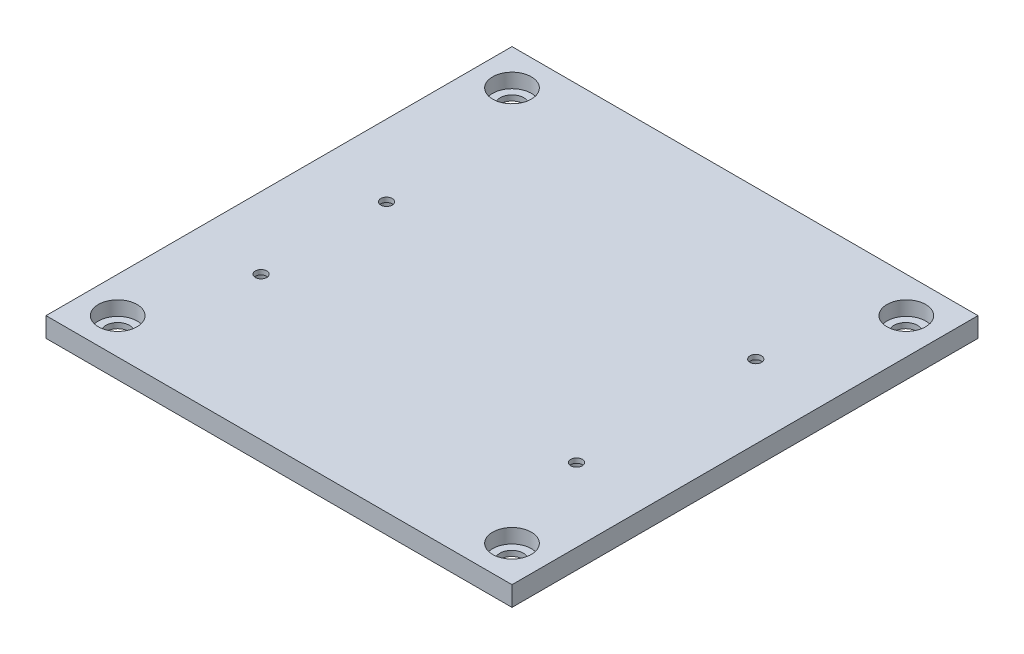
ISO-10303-21;
HEADER;
FILE_DESCRIPTION(('STEP AP214'),'2;1');
FILE_NAME('part.step','',(''),(''),'','','');
FILE_SCHEMA(('AUTOMOTIVE_DESIGN { 1 0 10303 214 1 1 1 1 }'));
ENDSEC;
DATA;
#1=APPLICATION_CONTEXT('core data for automotive mechanical design processes');
#2=APPLICATION_PROTOCOL_DEFINITION('international standard','automotive_design',2000,#1);
#3=PRODUCT_CONTEXT('',#1,'mechanical');
#4=PRODUCT('Part','Part','',(#3));
#5=PRODUCT_RELATED_PRODUCT_CATEGORY('part','',(#4));
#6=PRODUCT_DEFINITION_FORMATION('','',#4);
#7=PRODUCT_DEFINITION_CONTEXT('part definition',#1,'design');
#8=PRODUCT_DEFINITION('design','',#6,#7);
#9=PRODUCT_DEFINITION_SHAPE('','',#8);
#10=(LENGTH_UNIT() NAMED_UNIT(*) SI_UNIT(.MILLI.,.METRE.));
#11=(NAMED_UNIT(*) PLANE_ANGLE_UNIT() SI_UNIT($,.RADIAN.));
#12=(NAMED_UNIT(*) SI_UNIT($,.STERADIAN.) SOLID_ANGLE_UNIT());
#13=UNCERTAINTY_MEASURE_WITH_UNIT(LENGTH_MEASURE(1.E-05),#10,'distance_accuracy_value','');
#14=(GEOMETRIC_REPRESENTATION_CONTEXT(3) GLOBAL_UNCERTAINTY_ASSIGNED_CONTEXT((#13)) GLOBAL_UNIT_ASSIGNED_CONTEXT((#10,
#11,#12)) REPRESENTATION_CONTEXT('',''));
#15=CARTESIAN_POINT('',(0.,0.,0.));
#16=DIRECTION('',(0.,0.,1.));
#17=DIRECTION('',(1.,0.,0.));
#18=AXIS2_PLACEMENT_3D('',#15,#16,#17);
#19=CARTESIAN_POINT('',(0.,5.5,0.));
#20=DIRECTION('',(1.,0.,0.));
#21=DIRECTION('',(0.,0.,-1.));
#22=AXIS2_PLACEMENT_3D('',#19,#20,#21);
#23=PLANE('',#22);
#24=DIRECTION('',(0.,0.,1.));
#25=VECTOR('',#24,1.);
#26=CARTESIAN_POINT('',(0.,0.,0.));
#27=LINE('',#26,#25);
#28=CARTESIAN_POINT('',(0.,0.,-130.));
#29=VERTEX_POINT('',#28);
#30=CARTESIAN_POINT('',(0.,0.,0.));
#31=VERTEX_POINT('',#30);
#32=EDGE_CURVE('E109',#29,#31,#27,.T.);
#33=ORIENTED_EDGE('',*,*,#32,.T.);
#34=DIRECTION('',(0.,-1.,0.));
#35=VECTOR('',#34,1.);
#36=CARTESIAN_POINT('',(0.,5.5,0.));
#37=LINE('',#36,#35);
#38=CARTESIAN_POINT('',(0.,5.5,0.));
#39=VERTEX_POINT('',#38);
#40=EDGE_CURVE('E11',#39,#31,#37,.T.);
#41=ORIENTED_EDGE('',*,*,#40,.F.);
#42=DIRECTION('',(0.,0.,1.));
#43=VECTOR('',#42,1.);
#44=CARTESIAN_POINT('',(0.,5.5,0.));
#45=LINE('',#44,#43);
#46=CARTESIAN_POINT('',(0.,5.5,-130.));
#47=VERTEX_POINT('',#46);
#48=EDGE_CURVE('E93',#47,#39,#45,.T.);
#49=ORIENTED_EDGE('',*,*,#48,.F.);
#50=DIRECTION('',(0.,-1.,0.));
#51=VECTOR('',#50,1.);
#52=CARTESIAN_POINT('',(0.,5.5,-130.));
#53=LINE('',#52,#51);
#54=EDGE_CURVE('E105',#47,#29,#53,.T.);
#55=ORIENTED_EDGE('',*,*,#54,.T.);
#56=EDGE_LOOP('',(#33,#41,#49,#55));
#57=FACE_BOUND('',#56,.T.);
#58=ADVANCED_FACE('F41',(#57),#23,.F.);
#59=CARTESIAN_POINT('',(0.,5.5,0.));
#60=DIRECTION('',(0.,0.,-1.));
#61=DIRECTION('',(-1.,0.,0.));
#62=AXIS2_PLACEMENT_3D('',#59,#60,#61);
#63=PLANE('',#62);
#64=DIRECTION('',(1.,0.,0.));
#65=VECTOR('',#64,1.);
#66=CARTESIAN_POINT('',(0.,0.,0.));
#67=LINE('',#66,#65);
#68=CARTESIAN_POINT('',(130.,0.,0.));
#69=VERTEX_POINT('',#68);
#70=EDGE_CURVE('E98',#31,#69,#67,.T.);
#71=ORIENTED_EDGE('',*,*,#70,.T.);
#72=DIRECTION('',(0.,-1.,0.));
#73=VECTOR('',#72,1.);
#74=CARTESIAN_POINT('',(130.,5.5,0.));
#75=LINE('',#74,#73);
#76=CARTESIAN_POINT('',(130.,5.5,0.));
#77=VERTEX_POINT('',#76);
#78=EDGE_CURVE('E50',#77,#69,#75,.T.);
#79=ORIENTED_EDGE('',*,*,#78,.F.);
#80=DIRECTION('',(1.,0.,0.));
#81=VECTOR('',#80,1.);
#82=CARTESIAN_POINT('',(0.,5.5,0.));
#83=LINE('',#82,#81);
#84=EDGE_CURVE('E88',#39,#77,#83,.T.);
#85=ORIENTED_EDGE('',*,*,#84,.F.);
#86=ORIENTED_EDGE('',*,*,#40,.T.);
#87=EDGE_LOOP('',(#71,#79,#85,#86));
#88=FACE_BOUND('',#87,.T.);
#89=ADVANCED_FACE('F97',(#88),#63,.F.);
#90=CARTESIAN_POINT('',(130.,5.5,0.));
#91=DIRECTION('',(-1.,0.,0.));
#92=DIRECTION('',(0.,0.,1.));
#93=AXIS2_PLACEMENT_3D('',#90,#91,#92);
#94=PLANE('',#93);
#95=DIRECTION('',(0.,0.,-1.));
#96=VECTOR('',#95,1.);
#97=CARTESIAN_POINT('',(130.,0.,0.));
#98=LINE('',#97,#96);
#99=CARTESIAN_POINT('',(130.,0.,-130.));
#100=VERTEX_POINT('',#99);
#101=EDGE_CURVE('E75',#69,#100,#98,.T.);
#102=ORIENTED_EDGE('',*,*,#101,.T.);
#103=DIRECTION('',(0.,-1.,0.));
#104=VECTOR('',#103,1.);
#105=CARTESIAN_POINT('',(130.,5.5,-130.));
#106=LINE('',#105,#104);
#107=CARTESIAN_POINT('',(130.,5.5,-130.));
#108=VERTEX_POINT('',#107);
#109=EDGE_CURVE('E100',#108,#100,#106,.T.);
#110=ORIENTED_EDGE('',*,*,#109,.F.);
#111=DIRECTION('',(0.,0.,-1.));
#112=VECTOR('',#111,1.);
#113=CARTESIAN_POINT('',(130.,5.5,0.));
#114=LINE('',#113,#112);
#115=EDGE_CURVE('E91',#77,#108,#114,.T.);
#116=ORIENTED_EDGE('',*,*,#115,.F.);
#117=ORIENTED_EDGE('',*,*,#78,.T.);
#118=EDGE_LOOP('',(#102,#110,#116,#117));
#119=FACE_BOUND('',#118,.T.);
#120=ADVANCED_FACE('F101',(#119),#94,.F.);
#121=CARTESIAN_POINT('',(0.,5.5,-130.));
#122=DIRECTION('',(0.,0.,1.));
#123=DIRECTION('',(1.,0.,0.));
#124=AXIS2_PLACEMENT_3D('',#121,#122,#123);
#125=PLANE('',#124);
#126=DIRECTION('',(-1.,0.,0.));
#127=VECTOR('',#126,1.);
#128=CARTESIAN_POINT('',(0.,0.,-130.));
#129=LINE('',#128,#127);
#130=EDGE_CURVE('E81',#100,#29,#129,.T.);
#131=ORIENTED_EDGE('',*,*,#130,.T.);
#132=ORIENTED_EDGE('',*,*,#54,.F.);
#133=DIRECTION('',(-1.,0.,0.));
#134=VECTOR('',#133,1.);
#135=CARTESIAN_POINT('',(0.,5.5,-130.));
#136=LINE('',#135,#134);
#137=EDGE_CURVE('E58',#108,#47,#136,.T.);
#138=ORIENTED_EDGE('',*,*,#137,.F.);
#139=ORIENTED_EDGE('',*,*,#109,.T.);
#140=EDGE_LOOP('',(#131,#132,#138,#139));
#141=FACE_BOUND('',#140,.T.);
#142=ADVANCED_FACE('F123',(#141),#125,.F.);
#143=CARTESIAN_POINT('',(0.,5.5,0.));
#144=DIRECTION('',(0.,-1.,0.));
#145=DIRECTION('',(0.,0.,-1.));
#146=AXIS2_PLACEMENT_3D('',#143,#144,#145);
#147=PLANE('',#146);
#148=CARTESIAN_POINT('',(109.5,5.5,-88.5));
#149=DIRECTION('',(0.,-1.,0.));
#150=DIRECTION('',(0.,0.,-1.));
#151=AXIS2_PLACEMENT_3D('',#148,#149,#150);
#152=CIRCLE('',#151,1.60000000000001);
#153=CARTESIAN_POINT('',(109.5,5.5,-90.1));
#154=VERTEX_POINT('',#153);
#155=EDGE_CURVE('E238',#154,#154,#152,.T.);
#156=ORIENTED_EDGE('',*,*,#155,.T.);
#157=EDGE_LOOP('',(#156));
#158=FACE_BOUND('',#157,.T.);
#159=CARTESIAN_POINT('',(109.5,5.5,-38.5));
#160=DIRECTION('',(0.,-1.,0.));
#161=DIRECTION('',(0.,0.,-1.));
#162=AXIS2_PLACEMENT_3D('',#159,#160,#161);
#163=CIRCLE('',#162,1.60000000000001);
#164=CARTESIAN_POINT('',(109.5,5.5,-40.1));
#165=VERTEX_POINT('',#164);
#166=EDGE_CURVE('E246',#165,#165,#163,.T.);
#167=ORIENTED_EDGE('',*,*,#166,.T.);
#168=EDGE_LOOP('',(#167));
#169=FACE_BOUND('',#168,.T.);
#170=CARTESIAN_POINT('',(20.,5.5,-75.));
#171=DIRECTION('',(0.,-1.,0.));
#172=DIRECTION('',(0.,0.,-1.));
#173=AXIS2_PLACEMENT_3D('',#170,#171,#172);
#174=CIRCLE('',#173,1.6);
#175=CARTESIAN_POINT('',(20.,5.5,-76.6));
#176=VERTEX_POINT('',#175);
#177=EDGE_CURVE('E230',#176,#176,#174,.T.);
#178=ORIENTED_EDGE('',*,*,#177,.T.);
#179=EDGE_LOOP('',(#178));
#180=FACE_BOUND('',#179,.T.);
#181=CARTESIAN_POINT('',(20.,5.5,-40.));
#182=DIRECTION('',(0.,-1.,0.));
#183=DIRECTION('',(0.,0.,-1.));
#184=AXIS2_PLACEMENT_3D('',#181,#182,#183);
#185=CIRCLE('',#184,1.6);
#186=CARTESIAN_POINT('',(20.,5.5,-41.6));
#187=VERTEX_POINT('',#186);
#188=EDGE_CURVE('E207',#187,#187,#185,.T.);
#189=ORIENTED_EDGE('',*,*,#188,.T.);
#190=EDGE_LOOP('',(#189));
#191=FACE_BOUND('',#190,.T.);
#192=CARTESIAN_POINT('',(10.,5.5,-120.));
#193=DIRECTION('',(0.,1.,0.));
#194=DIRECTION('',(0.,0.,1.));
#195=AXIS2_PLACEMENT_3D('',#192,#193,#194);
#196=CIRCLE('',#195,5.4);
#197=CARTESIAN_POINT('',(10.,5.5,-114.6));
#198=VERTEX_POINT('',#197);
#199=EDGE_CURVE('E142',#198,#198,#196,.T.);
#200=ORIENTED_EDGE('',*,*,#199,.F.);
#201=EDGE_LOOP('',(#200));
#202=FACE_BOUND('',#201,.T.);
#203=CARTESIAN_POINT('',(120.,5.5,-120.));
#204=DIRECTION('',(0.,1.,0.));
#205=DIRECTION('',(0.,0.,1.));
#206=AXIS2_PLACEMENT_3D('',#203,#204,#205);
#207=CIRCLE('',#206,5.4);
#208=CARTESIAN_POINT('',(120.,5.5,-114.6));
#209=VERTEX_POINT('',#208);
#210=EDGE_CURVE('E151',#209,#209,#207,.T.);
#211=ORIENTED_EDGE('',*,*,#210,.F.);
#212=EDGE_LOOP('',(#211));
#213=FACE_BOUND('',#212,.T.);
#214=CARTESIAN_POINT('',(120.,5.5,-10.));
#215=DIRECTION('',(0.,1.,0.));
#216=DIRECTION('',(0.,0.,1.));
#217=AXIS2_PLACEMENT_3D('',#214,#215,#216);
#218=CIRCLE('',#217,5.39999999999999);
#219=CARTESIAN_POINT('',(120.,5.5,-4.60000000000001));
#220=VERTEX_POINT('',#219);
#221=EDGE_CURVE('E134',#220,#220,#218,.T.);
#222=ORIENTED_EDGE('',*,*,#221,.F.);
#223=EDGE_LOOP('',(#222));
#224=FACE_BOUND('',#223,.T.);
#225=CARTESIAN_POINT('',(10.,5.5,-10.));
#226=DIRECTION('',(0.,1.,0.));
#227=DIRECTION('',(0.,0.,1.));
#228=AXIS2_PLACEMENT_3D('',#225,#226,#227);
#229=CIRCLE('',#228,5.4);
#230=CARTESIAN_POINT('',(10.,5.5,-4.6));
#231=VERTEX_POINT('',#230);
#232=EDGE_CURVE('E130',#231,#231,#229,.T.);
#233=ORIENTED_EDGE('',*,*,#232,.F.);
#234=EDGE_LOOP('',(#233));
#235=FACE_BOUND('',#234,.T.);
#236=ORIENTED_EDGE('',*,*,#48,.T.);
#237=ORIENTED_EDGE('',*,*,#84,.T.);
#238=ORIENTED_EDGE('',*,*,#115,.T.);
#239=ORIENTED_EDGE('',*,*,#137,.T.);
#240=EDGE_LOOP('',(#236,#237,#238,#239));
#241=FACE_BOUND('',#240,.T.);
#242=ADVANCED_FACE('F89',(#158,#169,#180,#191,#202,#213,#224,#235,#241),#147,.F.);
#243=CARTESIAN_POINT('',(0.,0.,0.));
#244=DIRECTION('',(0.,-1.,0.));
#245=DIRECTION('',(0.,0.,-1.));
#246=AXIS2_PLACEMENT_3D('',#243,#244,#245);
#247=PLANE('',#246);
#248=CARTESIAN_POINT('',(109.5,0.,-88.5));
#249=DIRECTION('',(0.,-1.,0.));
#250=DIRECTION('',(0.,0.,-1.));
#251=AXIS2_PLACEMENT_3D('',#248,#249,#250);
#252=CIRCLE('',#251,3.1);
#253=CARTESIAN_POINT('',(109.5,0.,-91.6));
#254=VERTEX_POINT('',#253);
#255=EDGE_CURVE('E202',#254,#254,#252,.T.);
#256=ORIENTED_EDGE('',*,*,#255,.F.);
#257=EDGE_LOOP('',(#256));
#258=FACE_BOUND('',#257,.T.);
#259=CARTESIAN_POINT('',(109.5,0.,-38.5));
#260=DIRECTION('',(0.,-1.,0.));
#261=DIRECTION('',(0.,0.,-1.));
#262=AXIS2_PLACEMENT_3D('',#259,#260,#261);
#263=CIRCLE('',#262,3.1);
#264=CARTESIAN_POINT('',(109.5,0.,-41.6));
#265=VERTEX_POINT('',#264);
#266=EDGE_CURVE('E211',#265,#265,#263,.T.);
#267=ORIENTED_EDGE('',*,*,#266,.F.);
#268=EDGE_LOOP('',(#267));
#269=FACE_BOUND('',#268,.T.);
#270=CARTESIAN_POINT('',(20.,0.,-75.));
#271=DIRECTION('',(0.,-1.,0.));
#272=DIRECTION('',(0.,0.,-1.));
#273=AXIS2_PLACEMENT_3D('',#270,#271,#272);
#274=CIRCLE('',#273,3.1);
#275=CARTESIAN_POINT('',(20.,0.,-78.1));
#276=VERTEX_POINT('',#275);
#277=EDGE_CURVE('E219',#276,#276,#274,.T.);
#278=ORIENTED_EDGE('',*,*,#277,.F.);
#279=EDGE_LOOP('',(#278));
#280=FACE_BOUND('',#279,.T.);
#281=CARTESIAN_POINT('',(20.,0.,-40.));
#282=DIRECTION('',(0.,-1.,0.));
#283=DIRECTION('',(0.,0.,-1.));
#284=AXIS2_PLACEMENT_3D('',#281,#282,#283);
#285=CIRCLE('',#284,3.1);
#286=CARTESIAN_POINT('',(20.,0.,-43.1));
#287=VERTEX_POINT('',#286);
#288=EDGE_CURVE('E194',#287,#287,#285,.T.);
#289=ORIENTED_EDGE('',*,*,#288,.F.);
#290=EDGE_LOOP('',(#289));
#291=FACE_BOUND('',#290,.T.);
#292=CARTESIAN_POINT('',(119.916006428739,0.,-119.916006428739));
#293=DIRECTION('',(0.,1.,0.));
#294=DIRECTION('',(0.,0.,1.));
#295=AXIS2_PLACEMENT_3D('',#292,#293,#294);
#296=CIRCLE('',#295,3.3);
#297=CARTESIAN_POINT('',(119.916006428739,0.,-116.616006428739));
#298=VERTEX_POINT('',#297);
#299=EDGE_CURVE('E166',#298,#298,#296,.T.);
#300=ORIENTED_EDGE('',*,*,#299,.T.);
#301=EDGE_LOOP('',(#300));
#302=FACE_BOUND('',#301,.T.);
#303=CARTESIAN_POINT('',(10.,0.,-10.));
#304=DIRECTION('',(0.,1.,0.));
#305=DIRECTION('',(0.,0.,1.));
#306=AXIS2_PLACEMENT_3D('',#303,#304,#305);
#307=CIRCLE('',#306,3.3);
#308=CARTESIAN_POINT('',(10.,0.,-6.7));
#309=VERTEX_POINT('',#308);
#310=EDGE_CURVE('E174',#309,#309,#307,.T.);
#311=ORIENTED_EDGE('',*,*,#310,.T.);
#312=EDGE_LOOP('',(#311));
#313=FACE_BOUND('',#312,.T.);
#314=CARTESIAN_POINT('',(120.,0.,-9.91600642873873));
#315=DIRECTION('',(0.,1.,0.));
#316=DIRECTION('',(0.,0.,1.));
#317=AXIS2_PLACEMENT_3D('',#314,#315,#316);
#318=CIRCLE('',#317,3.3);
#319=CARTESIAN_POINT('',(120.,0.,-6.61600642873873));
#320=VERTEX_POINT('',#319);
#321=EDGE_CURVE('E175',#320,#320,#318,.T.);
#322=ORIENTED_EDGE('',*,*,#321,.T.);
#323=EDGE_LOOP('',(#322));
#324=FACE_BOUND('',#323,.T.);
#325=CARTESIAN_POINT('',(10.,0.,-120.));
#326=DIRECTION('',(0.,1.,0.));
#327=DIRECTION('',(0.,0.,1.));
#328=AXIS2_PLACEMENT_3D('',#325,#326,#327);
#329=CIRCLE('',#328,3.3);
#330=CARTESIAN_POINT('',(10.,0.,-116.7));
#331=VERTEX_POINT('',#330);
#332=EDGE_CURVE('E143',#331,#331,#329,.T.);
#333=ORIENTED_EDGE('',*,*,#332,.T.);
#334=EDGE_LOOP('',(#333));
#335=FACE_BOUND('',#334,.T.);
#336=ORIENTED_EDGE('',*,*,#32,.F.);
#337=ORIENTED_EDGE('',*,*,#130,.F.);
#338=ORIENTED_EDGE('',*,*,#101,.F.);
#339=ORIENTED_EDGE('',*,*,#70,.F.);
#340=EDGE_LOOP('',(#336,#337,#338,#339));
#341=FACE_BOUND('',#340,.T.);
#342=ADVANCED_FACE('F126',(#258,#269,#280,#291,#302,#313,#324,#335,#341),#247,.T.);
#343=CARTESIAN_POINT('',(10.,1.5,-10.));
#344=DIRECTION('',(0.,1.,0.));
#345=DIRECTION('',(0.,0.,1.));
#346=AXIS2_PLACEMENT_3D('',#343,#344,#345);
#347=CYLINDRICAL_SURFACE('',#346,5.4);
#348=CARTESIAN_POINT('',(10.,1.5,-10.));
#349=DIRECTION('',(0.,1.,0.));
#350=DIRECTION('',(0.,0.,1.));
#351=AXIS2_PLACEMENT_3D('',#348,#349,#350);
#352=CIRCLE('',#351,5.4);
#353=CARTESIAN_POINT('',(10.,1.5,-4.6));
#354=VERTEX_POINT('',#353);
#355=EDGE_CURVE('E113',#354,#354,#352,.T.);
#356=ORIENTED_EDGE('',*,*,#355,.F.);
#357=EDGE_LOOP('',(#356));
#358=FACE_BOUND('',#357,.T.);
#359=ORIENTED_EDGE('',*,*,#232,.T.);
#360=EDGE_LOOP('',(#359));
#361=FACE_BOUND('',#360,.T.);
#362=ADVANCED_FACE('F284',(#358,#361),#347,.F.);
#363=CARTESIAN_POINT('',(10.,1.5,-10.));
#364=DIRECTION('',(0.,1.,0.));
#365=DIRECTION('',(0.,0.,1.));
#366=AXIS2_PLACEMENT_3D('',#363,#364,#365);
#367=PLANE('',#366);
#368=CARTESIAN_POINT('',(10.,1.5,-10.));
#369=DIRECTION('',(0.,1.,0.));
#370=DIRECTION('',(0.,0.,1.));
#371=AXIS2_PLACEMENT_3D('',#368,#369,#370);
#372=CIRCLE('',#371,3.3);
#373=CARTESIAN_POINT('',(10.,1.5,-6.7));
#374=VERTEX_POINT('',#373);
#375=EDGE_CURVE('E170',#374,#374,#372,.T.);
#376=ORIENTED_EDGE('',*,*,#375,.F.);
#377=EDGE_LOOP('',(#376));
#378=FACE_BOUND('',#377,.T.);
#379=ORIENTED_EDGE('',*,*,#355,.T.);
#380=EDGE_LOOP('',(#379));
#381=FACE_BOUND('',#380,.T.);
#382=ADVANCED_FACE('F328',(#378,#381),#367,.T.);
#383=CARTESIAN_POINT('',(120.,1.5,-10.));
#384=DIRECTION('',(0.,1.,0.));
#385=DIRECTION('',(0.,0.,1.));
#386=AXIS2_PLACEMENT_3D('',#383,#384,#385);
#387=CYLINDRICAL_SURFACE('',#386,5.39999999999999);
#388=CARTESIAN_POINT('',(120.,1.5,-10.));
#389=DIRECTION('',(0.,1.,0.));
#390=DIRECTION('',(0.,0.,1.));
#391=AXIS2_PLACEMENT_3D('',#388,#389,#390);
#392=CIRCLE('',#391,5.39999999999999);
#393=CARTESIAN_POINT('',(120.,1.5,-4.60000000000001));
#394=VERTEX_POINT('',#393);
#395=EDGE_CURVE('E155',#394,#394,#392,.T.);
#396=ORIENTED_EDGE('',*,*,#395,.F.);
#397=EDGE_LOOP('',(#396));
#398=FACE_BOUND('',#397,.T.);
#399=ORIENTED_EDGE('',*,*,#221,.T.);
#400=EDGE_LOOP('',(#399));
#401=FACE_BOUND('',#400,.T.);
#402=ADVANCED_FACE('F334',(#398,#401),#387,.F.);
#403=CARTESIAN_POINT('',(120.,1.5,-10.));
#404=DIRECTION('',(0.,1.,0.));
#405=DIRECTION('',(0.,0.,1.));
#406=AXIS2_PLACEMENT_3D('',#403,#404,#405);
#407=PLANE('',#406);
#408=CARTESIAN_POINT('',(120.,1.5,-9.91600642873873));
#409=DIRECTION('',(0.,1.,0.));
#410=DIRECTION('',(0.,0.,1.));
#411=AXIS2_PLACEMENT_3D('',#408,#409,#410);
#412=CIRCLE('',#411,3.3);
#413=CARTESIAN_POINT('',(120.,1.5,-6.61600642873873));
#414=VERTEX_POINT('',#413);
#415=EDGE_CURVE('E186',#414,#414,#412,.T.);
#416=ORIENTED_EDGE('',*,*,#415,.F.);
#417=EDGE_LOOP('',(#416));
#418=FACE_BOUND('',#417,.T.);
#419=ORIENTED_EDGE('',*,*,#395,.T.);
#420=EDGE_LOOP('',(#419));
#421=FACE_BOUND('',#420,.T.);
#422=ADVANCED_FACE('F493',(#418,#421),#407,.T.);
#423=CARTESIAN_POINT('',(120.,1.5,-120.));
#424=DIRECTION('',(0.,1.,0.));
#425=DIRECTION('',(0.,0.,1.));
#426=AXIS2_PLACEMENT_3D('',#423,#424,#425);
#427=CYLINDRICAL_SURFACE('',#426,5.4);
#428=CARTESIAN_POINT('',(120.,1.5,-120.));
#429=DIRECTION('',(0.,1.,0.));
#430=DIRECTION('',(0.,0.,1.));
#431=AXIS2_PLACEMENT_3D('',#428,#429,#430);
#432=CIRCLE('',#431,5.4);
#433=CARTESIAN_POINT('',(120.,1.5,-114.6));
#434=VERTEX_POINT('',#433);
#435=EDGE_CURVE('E147',#434,#434,#432,.T.);
#436=ORIENTED_EDGE('',*,*,#435,.F.);
#437=EDGE_LOOP('',(#436));
#438=FACE_BOUND('',#437,.T.);
#439=ORIENTED_EDGE('',*,*,#210,.T.);
#440=EDGE_LOOP('',(#439));
#441=FACE_BOUND('',#440,.T.);
#442=ADVANCED_FACE('F497',(#438,#441),#427,.F.);
#443=CARTESIAN_POINT('',(120.,1.5,-120.));
#444=DIRECTION('',(0.,1.,0.));
#445=DIRECTION('',(0.,0.,1.));
#446=AXIS2_PLACEMENT_3D('',#443,#444,#445);
#447=PLANE('',#446);
#448=CARTESIAN_POINT('',(119.916006428739,1.5,-119.916006428739));
#449=DIRECTION('',(0.,1.,0.));
#450=DIRECTION('',(0.,0.,1.));
#451=AXIS2_PLACEMENT_3D('',#448,#449,#450);
#452=CIRCLE('',#451,3.3);
#453=CARTESIAN_POINT('',(119.916006428739,1.5,-116.616006428739));
#454=VERTEX_POINT('',#453);
#455=EDGE_CURVE('E179',#454,#454,#452,.T.);
#456=ORIENTED_EDGE('',*,*,#455,.F.);
#457=EDGE_LOOP('',(#456));
#458=FACE_BOUND('',#457,.T.);
#459=ORIENTED_EDGE('',*,*,#435,.T.);
#460=EDGE_LOOP('',(#459));
#461=FACE_BOUND('',#460,.T.);
#462=ADVANCED_FACE('F313',(#458,#461),#447,.T.);
#463=CARTESIAN_POINT('',(10.,1.5,-120.));
#464=DIRECTION('',(0.,1.,0.));
#465=DIRECTION('',(0.,0.,1.));
#466=AXIS2_PLACEMENT_3D('',#463,#464,#465);
#467=CYLINDRICAL_SURFACE('',#466,5.4);
#468=CARTESIAN_POINT('',(10.,1.5,-120.));
#469=DIRECTION('',(0.,1.,0.));
#470=DIRECTION('',(0.,0.,1.));
#471=AXIS2_PLACEMENT_3D('',#468,#469,#470);
#472=CIRCLE('',#471,5.4);
#473=CARTESIAN_POINT('',(10.,1.5,-114.6));
#474=VERTEX_POINT('',#473);
#475=EDGE_CURVE('E138',#474,#474,#472,.T.);
#476=ORIENTED_EDGE('',*,*,#475,.F.);
#477=EDGE_LOOP('',(#476));
#478=FACE_BOUND('',#477,.T.);
#479=ORIENTED_EDGE('',*,*,#199,.T.);
#480=EDGE_LOOP('',(#479));
#481=FACE_BOUND('',#480,.T.);
#482=ADVANCED_FACE('F307',(#478,#481),#467,.F.);
#483=CARTESIAN_POINT('',(10.,1.5,-120.));
#484=DIRECTION('',(0.,1.,0.));
#485=DIRECTION('',(0.,0.,1.));
#486=AXIS2_PLACEMENT_3D('',#483,#484,#485);
#487=PLANE('',#486);
#488=CARTESIAN_POINT('',(10.,1.5,-120.));
#489=DIRECTION('',(0.,1.,0.));
#490=DIRECTION('',(0.,0.,1.));
#491=AXIS2_PLACEMENT_3D('',#488,#489,#490);
#492=CIRCLE('',#491,3.3);
#493=CARTESIAN_POINT('',(10.,1.5,-116.7));
#494=VERTEX_POINT('',#493);
#495=EDGE_CURVE('E162',#494,#494,#492,.T.);
#496=ORIENTED_EDGE('',*,*,#495,.F.);
#497=EDGE_LOOP('',(#496));
#498=FACE_BOUND('',#497,.T.);
#499=ORIENTED_EDGE('',*,*,#475,.T.);
#500=EDGE_LOOP('',(#499));
#501=FACE_BOUND('',#500,.T.);
#502=ADVANCED_FACE('F301',(#498,#501),#487,.T.);
#503=CARTESIAN_POINT('',(10.,0.,-120.));
#504=DIRECTION('',(0.,1.,0.));
#505=DIRECTION('',(0.,0.,1.));
#506=AXIS2_PLACEMENT_3D('',#503,#504,#505);
#507=CYLINDRICAL_SURFACE('',#506,3.3);
#508=ORIENTED_EDGE('',*,*,#332,.F.);
#509=EDGE_LOOP('',(#508));
#510=FACE_BOUND('',#509,.T.);
#511=ORIENTED_EDGE('',*,*,#495,.T.);
#512=EDGE_LOOP('',(#511));
#513=FACE_BOUND('',#512,.T.);
#514=ADVANCED_FACE('F297',(#510,#513),#507,.F.);
#515=CARTESIAN_POINT('',(120.,0.,-9.91600642873873));
#516=DIRECTION('',(0.,1.,0.));
#517=DIRECTION('',(0.,0.,1.));
#518=AXIS2_PLACEMENT_3D('',#515,#516,#517);
#519=CYLINDRICAL_SURFACE('',#518,3.3);
#520=ORIENTED_EDGE('',*,*,#321,.F.);
#521=EDGE_LOOP('',(#520));
#522=FACE_BOUND('',#521,.T.);
#523=ORIENTED_EDGE('',*,*,#415,.T.);
#524=EDGE_LOOP('',(#523));
#525=FACE_BOUND('',#524,.T.);
#526=ADVANCED_FACE('F300',(#522,#525),#519,.F.);
#527=CARTESIAN_POINT('',(10.,0.,-10.));
#528=DIRECTION('',(0.,1.,0.));
#529=DIRECTION('',(0.,0.,1.));
#530=AXIS2_PLACEMENT_3D('',#527,#528,#529);
#531=CYLINDRICAL_SURFACE('',#530,3.3);
#532=ORIENTED_EDGE('',*,*,#310,.F.);
#533=EDGE_LOOP('',(#532));
#534=FACE_BOUND('',#533,.T.);
#535=ORIENTED_EDGE('',*,*,#375,.T.);
#536=EDGE_LOOP('',(#535));
#537=FACE_BOUND('',#536,.T.);
#538=ADVANCED_FACE('F484',(#534,#537),#531,.F.);
#539=CARTESIAN_POINT('',(119.916006428739,0.,-119.916006428739));
#540=DIRECTION('',(0.,1.,0.));
#541=DIRECTION('',(0.,0.,1.));
#542=AXIS2_PLACEMENT_3D('',#539,#540,#541);
#543=CYLINDRICAL_SURFACE('',#542,3.3);
#544=ORIENTED_EDGE('',*,*,#299,.F.);
#545=EDGE_LOOP('',(#544));
#546=FACE_BOUND('',#545,.T.);
#547=ORIENTED_EDGE('',*,*,#455,.T.);
#548=EDGE_LOOP('',(#547));
#549=FACE_BOUND('',#548,.T.);
#550=ADVANCED_FACE('F367',(#546,#549),#543,.F.);
#551=CARTESIAN_POINT('',(20.,4.2,-40.));
#552=DIRECTION('',(0.,-1.,0.));
#553=DIRECTION('',(0.,0.,-1.));
#554=AXIS2_PLACEMENT_3D('',#551,#552,#553);
#555=CYLINDRICAL_SURFACE('',#554,3.1);
#556=CARTESIAN_POINT('',(20.,4.2,-40.));
#557=DIRECTION('',(0.,-1.,0.));
#558=DIRECTION('',(0.,0.,-1.));
#559=AXIS2_PLACEMENT_3D('',#556,#557,#558);
#560=CIRCLE('',#559,3.1);
#561=CARTESIAN_POINT('',(20.,4.2,-43.1));
#562=VERTEX_POINT('',#561);
#563=EDGE_CURVE('E190',#562,#562,#560,.T.);
#564=ORIENTED_EDGE('',*,*,#563,.F.);
#565=EDGE_LOOP('',(#564));
#566=FACE_BOUND('',#565,.T.);
#567=ORIENTED_EDGE('',*,*,#288,.T.);
#568=EDGE_LOOP('',(#567));
#569=FACE_BOUND('',#568,.T.);
#570=ADVANCED_FACE('F372',(#566,#569),#555,.F.);
#571=CARTESIAN_POINT('',(20.,4.2,-40.));
#572=DIRECTION('',(0.,-1.,0.));
#573=DIRECTION('',(0.,0.,-1.));
#574=AXIS2_PLACEMENT_3D('',#571,#572,#573);
#575=PLANE('',#574);
#576=CARTESIAN_POINT('',(20.,4.2,-40.));
#577=DIRECTION('',(0.,-1.,0.));
#578=DIRECTION('',(0.,0.,-1.));
#579=AXIS2_PLACEMENT_3D('',#576,#577,#578);
#580=CIRCLE('',#579,1.6);
#581=CARTESIAN_POINT('',(20.,4.2,-41.6));
#582=VERTEX_POINT('',#581);
#583=EDGE_CURVE('E226',#582,#582,#580,.T.);
#584=ORIENTED_EDGE('',*,*,#583,.F.);
#585=EDGE_LOOP('',(#584));
#586=FACE_BOUND('',#585,.T.);
#587=ORIENTED_EDGE('',*,*,#563,.T.);
#588=EDGE_LOOP('',(#587));
#589=FACE_BOUND('',#588,.T.);
#590=ADVANCED_FACE('F278',(#586,#589),#575,.T.);
#591=CARTESIAN_POINT('',(20.,4.2,-75.));
#592=DIRECTION('',(0.,-1.,0.));
#593=DIRECTION('',(0.,0.,-1.));
#594=AXIS2_PLACEMENT_3D('',#591,#592,#593);
#595=CYLINDRICAL_SURFACE('',#594,3.1);
#596=CARTESIAN_POINT('',(20.,4.2,-75.));
#597=DIRECTION('',(0.,-1.,0.));
#598=DIRECTION('',(0.,0.,-1.));
#599=AXIS2_PLACEMENT_3D('',#596,#597,#598);
#600=CIRCLE('',#599,3.1);
#601=CARTESIAN_POINT('',(20.,4.2,-78.1));
#602=VERTEX_POINT('',#601);
#603=EDGE_CURVE('E198',#602,#602,#600,.T.);
#604=ORIENTED_EDGE('',*,*,#603,.F.);
#605=EDGE_LOOP('',(#604));
#606=FACE_BOUND('',#605,.T.);
#607=ORIENTED_EDGE('',*,*,#277,.T.);
#608=EDGE_LOOP('',(#607));
#609=FACE_BOUND('',#608,.T.);
#610=ADVANCED_FACE('F272',(#606,#609),#595,.F.);
#611=CARTESIAN_POINT('',(20.,4.2,-75.));
#612=DIRECTION('',(0.,-1.,0.));
#613=DIRECTION('',(0.,0.,-1.));
#614=AXIS2_PLACEMENT_3D('',#611,#612,#613);
#615=PLANE('',#614);
#616=CARTESIAN_POINT('',(20.,4.2,-75.));
#617=DIRECTION('',(0.,-1.,0.));
#618=DIRECTION('',(0.,0.,-1.));
#619=AXIS2_PLACEMENT_3D('',#616,#617,#618);
#620=CIRCLE('',#619,1.6);
#621=CARTESIAN_POINT('',(20.,4.2,-76.6));
#622=VERTEX_POINT('',#621);
#623=EDGE_CURVE('E250',#622,#622,#620,.T.);
#624=ORIENTED_EDGE('',*,*,#623,.F.);
#625=EDGE_LOOP('',(#624));
#626=FACE_BOUND('',#625,.T.);
#627=ORIENTED_EDGE('',*,*,#603,.T.);
#628=EDGE_LOOP('',(#627));
#629=FACE_BOUND('',#628,.T.);
#630=ADVANCED_FACE('F268',(#626,#629),#615,.T.);
#631=CARTESIAN_POINT('',(109.5,4.2,-38.5));
#632=DIRECTION('',(0.,-1.,0.));
#633=DIRECTION('',(0.,0.,-1.));
#634=AXIS2_PLACEMENT_3D('',#631,#632,#633);
#635=CYLINDRICAL_SURFACE('',#634,3.1);
#636=CARTESIAN_POINT('',(109.5,4.2,-38.5));
#637=DIRECTION('',(0.,-1.,0.));
#638=DIRECTION('',(0.,0.,-1.));
#639=AXIS2_PLACEMENT_3D('',#636,#637,#638);
#640=CIRCLE('',#639,3.1);
#641=CARTESIAN_POINT('',(109.5,4.2,-41.6));
#642=VERTEX_POINT('',#641);
#643=EDGE_CURVE('E215',#642,#642,#640,.T.);
#644=ORIENTED_EDGE('',*,*,#643,.F.);
#645=EDGE_LOOP('',(#644));
#646=FACE_BOUND('',#645,.T.);
#647=ORIENTED_EDGE('',*,*,#266,.T.);
#648=EDGE_LOOP('',(#647));
#649=FACE_BOUND('',#648,.T.);
#650=ADVANCED_FACE('F271',(#646,#649),#635,.F.);
#651=CARTESIAN_POINT('',(109.5,4.2,-38.5));
#652=DIRECTION('',(0.,-1.,0.));
#653=DIRECTION('',(0.,0.,-1.));
#654=AXIS2_PLACEMENT_3D('',#651,#652,#653);
#655=PLANE('',#654);
#656=CARTESIAN_POINT('',(109.5,4.2,-38.5));
#657=DIRECTION('',(0.,-1.,0.));
#658=DIRECTION('',(0.,0.,-1.));
#659=AXIS2_PLACEMENT_3D('',#656,#657,#658);
#660=CIRCLE('',#659,1.60000000000001);
#661=CARTESIAN_POINT('',(109.5,4.2,-40.1));
#662=VERTEX_POINT('',#661);
#663=EDGE_CURVE('E242',#662,#662,#660,.T.);
#664=ORIENTED_EDGE('',*,*,#663,.F.);
#665=EDGE_LOOP('',(#664));
#666=FACE_BOUND('',#665,.T.);
#667=ORIENTED_EDGE('',*,*,#643,.T.);
#668=EDGE_LOOP('',(#667));
#669=FACE_BOUND('',#668,.T.);
#670=ADVANCED_FACE('F395',(#666,#669),#655,.T.);
#671=CARTESIAN_POINT('',(109.5,4.2,-88.5));
#672=DIRECTION('',(0.,-1.,0.));
#673=DIRECTION('',(0.,0.,-1.));
#674=AXIS2_PLACEMENT_3D('',#671,#672,#673);
#675=CYLINDRICAL_SURFACE('',#674,3.1);
#676=CARTESIAN_POINT('',(109.5,4.2,-88.5));
#677=DIRECTION('',(0.,-1.,0.));
#678=DIRECTION('',(0.,0.,-1.));
#679=AXIS2_PLACEMENT_3D('',#676,#677,#678);
#680=CIRCLE('',#679,3.1);
#681=CARTESIAN_POINT('',(109.5,4.2,-91.6));
#682=VERTEX_POINT('',#681);
#683=EDGE_CURVE('E206',#682,#682,#680,.T.);
#684=ORIENTED_EDGE('',*,*,#683,.F.);
#685=EDGE_LOOP('',(#684));
#686=FACE_BOUND('',#685,.T.);
#687=ORIENTED_EDGE('',*,*,#255,.T.);
#688=EDGE_LOOP('',(#687));
#689=FACE_BOUND('',#688,.T.);
#690=ADVANCED_FACE('F403',(#686,#689),#675,.F.);
#691=CARTESIAN_POINT('',(109.5,4.2,-88.5));
#692=DIRECTION('',(0.,-1.,0.));
#693=DIRECTION('',(0.,0.,-1.));
#694=AXIS2_PLACEMENT_3D('',#691,#692,#693);
#695=PLANE('',#694);
#696=CARTESIAN_POINT('',(109.5,4.2,-88.5));
#697=DIRECTION('',(0.,-1.,0.));
#698=DIRECTION('',(0.,0.,-1.));
#699=AXIS2_PLACEMENT_3D('',#696,#697,#698);
#700=CIRCLE('',#699,1.60000000000001);
#701=CARTESIAN_POINT('',(109.5,4.2,-90.1));
#702=VERTEX_POINT('',#701);
#703=EDGE_CURVE('E234',#702,#702,#700,.T.);
#704=ORIENTED_EDGE('',*,*,#703,.F.);
#705=EDGE_LOOP('',(#704));
#706=FACE_BOUND('',#705,.T.);
#707=ORIENTED_EDGE('',*,*,#683,.T.);
#708=EDGE_LOOP('',(#707));
#709=FACE_BOUND('',#708,.T.);
#710=ADVANCED_FACE('F407',(#706,#709),#695,.T.);
#711=CARTESIAN_POINT('',(20.,5.5,-40.));
#712=DIRECTION('',(0.,-1.,0.));
#713=DIRECTION('',(0.,0.,-1.));
#714=AXIS2_PLACEMENT_3D('',#711,#712,#713);
#715=CYLINDRICAL_SURFACE('',#714,1.6);
#716=ORIENTED_EDGE('',*,*,#188,.F.);
#717=EDGE_LOOP('',(#716));
#718=FACE_BOUND('',#717,.T.);
#719=ORIENTED_EDGE('',*,*,#583,.T.);
#720=EDGE_LOOP('',(#719));
#721=FACE_BOUND('',#720,.T.);
#722=ADVANCED_FACE('F264',(#718,#721),#715,.F.);
#723=CARTESIAN_POINT('',(20.,5.5,-75.));
#724=DIRECTION('',(0.,-1.,0.));
#725=DIRECTION('',(0.,0.,-1.));
#726=AXIS2_PLACEMENT_3D('',#723,#724,#725);
#727=CYLINDRICAL_SURFACE('',#726,1.6);
#728=ORIENTED_EDGE('',*,*,#177,.F.);
#729=EDGE_LOOP('',(#728));
#730=FACE_BOUND('',#729,.T.);
#731=ORIENTED_EDGE('',*,*,#623,.T.);
#732=EDGE_LOOP('',(#731));
#733=FACE_BOUND('',#732,.T.);
#734=ADVANCED_FACE('F260',(#730,#733),#727,.F.);
#735=CARTESIAN_POINT('',(109.5,5.5,-38.5));
#736=DIRECTION('',(0.,-1.,0.));
#737=DIRECTION('',(0.,0.,-1.));
#738=AXIS2_PLACEMENT_3D('',#735,#736,#737);
#739=CYLINDRICAL_SURFACE('',#738,1.60000000000001);
#740=ORIENTED_EDGE('',*,*,#166,.F.);
#741=EDGE_LOOP('',(#740));
#742=FACE_BOUND('',#741,.T.);
#743=ORIENTED_EDGE('',*,*,#663,.T.);
#744=EDGE_LOOP('',(#743));
#745=FACE_BOUND('',#744,.T.);
#746=ADVANCED_FACE('F263',(#742,#745),#739,.F.);
#747=CARTESIAN_POINT('',(109.5,5.5,-88.5));
#748=DIRECTION('',(0.,-1.,0.));
#749=DIRECTION('',(0.,0.,-1.));
#750=AXIS2_PLACEMENT_3D('',#747,#748,#749);
#751=CYLINDRICAL_SURFACE('',#750,1.60000000000001);
#752=ORIENTED_EDGE('',*,*,#155,.F.);
#753=EDGE_LOOP('',(#752));
#754=FACE_BOUND('',#753,.T.);
#755=ORIENTED_EDGE('',*,*,#703,.T.);
#756=EDGE_LOOP('',(#755));
#757=FACE_BOUND('',#756,.T.);
#758=ADVANCED_FACE('F465',(#754,#757),#751,.F.);
#759=CLOSED_SHELL('',(#58,#89,#120,#142,#242,#342,#362,#382,#402,#422,#442,#462,#482,#502,#514,
#526,#538,#550,#570,#590,#610,#630,#650,#670,#690,#710,#722,#734,#746,#758));
#760=MANIFOLD_SOLID_BREP('B2',#759);
#761=ADVANCED_BREP_SHAPE_REPRESENTATION('',(#18,#760),#14);
#762=SHAPE_DEFINITION_REPRESENTATION(#9,#761);
ENDSEC;
END-ISO-10303-21;
